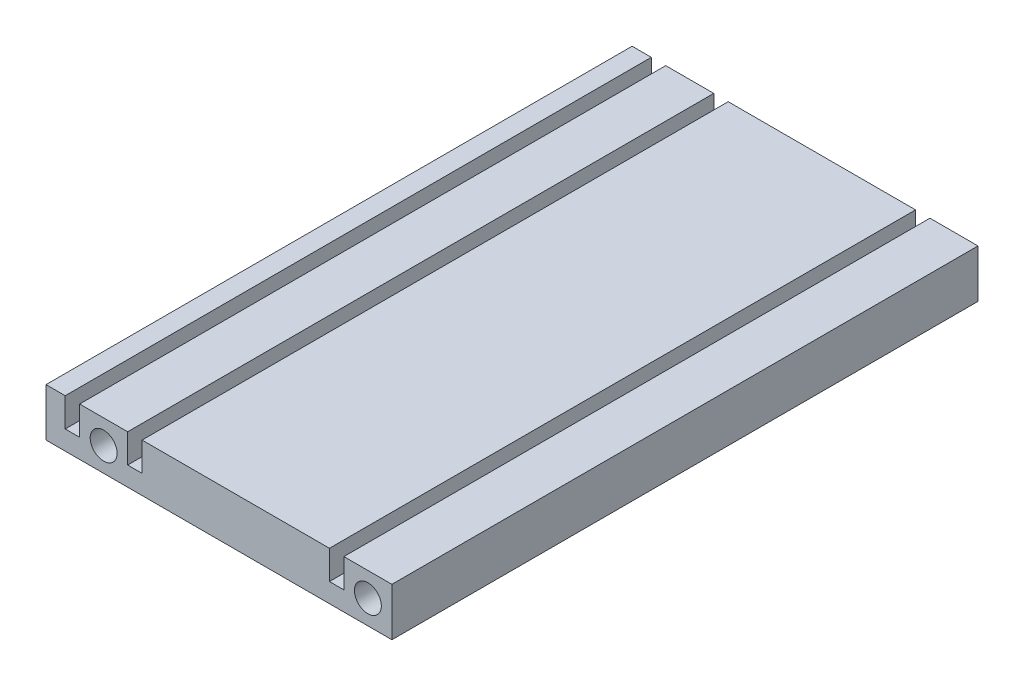
ISO-10303-21;
HEADER;
FILE_DESCRIPTION(('STEP AP214'),'2;1');
FILE_NAME('part.step','',(''),(''),'','','');
FILE_SCHEMA(('AUTOMOTIVE_DESIGN { 1 0 10303 214 1 1 1 1 }'));
ENDSEC;
DATA;
#1=APPLICATION_CONTEXT('core data for automotive mechanical design processes');
#2=APPLICATION_PROTOCOL_DEFINITION('international standard','automotive_design',2000,#1);
#3=PRODUCT_CONTEXT('',#1,'mechanical');
#4=PRODUCT('Part','Part','',(#3));
#5=PRODUCT_RELATED_PRODUCT_CATEGORY('part','',(#4));
#6=PRODUCT_DEFINITION_FORMATION('','',#4);
#7=PRODUCT_DEFINITION_CONTEXT('part definition',#1,'design');
#8=PRODUCT_DEFINITION('design','',#6,#7);
#9=PRODUCT_DEFINITION_SHAPE('','',#8);
#10=(LENGTH_UNIT() NAMED_UNIT(*) SI_UNIT(.MILLI.,.METRE.));
#11=(NAMED_UNIT(*) PLANE_ANGLE_UNIT() SI_UNIT($,.RADIAN.));
#12=(NAMED_UNIT(*) SI_UNIT($,.STERADIAN.) SOLID_ANGLE_UNIT());
#13=UNCERTAINTY_MEASURE_WITH_UNIT(LENGTH_MEASURE(1.E-05),#10,'distance_accuracy_value','');
#14=(GEOMETRIC_REPRESENTATION_CONTEXT(3) GLOBAL_UNCERTAINTY_ASSIGNED_CONTEXT((#13)) GLOBAL_UNIT_ASSIGNED_CONTEXT((#10,
#11,#12)) REPRESENTATION_CONTEXT('',''));
#15=CARTESIAN_POINT('',(0.,0.,0.));
#16=DIRECTION('',(0.,0.,1.));
#17=DIRECTION('',(1.,0.,0.));
#18=AXIS2_PLACEMENT_3D('',#15,#16,#17);
#19=CARTESIAN_POINT('',(0.,0.,122.));
#20=DIRECTION('',(0.,0.,1.));
#21=DIRECTION('',(1.,0.,0.));
#22=AXIS2_PLACEMENT_3D('',#19,#20,#21);
#23=PLANE('',#22);
#24=CARTESIAN_POINT('',(31.1088733696482,1.91039679647407,122.));
#25=DIRECTION('',(0.,0.,1.));
#26=DIRECTION('',(1.,0.,0.));
#27=AXIS2_PLACEMENT_3D('',#24,#25,#26);
#28=CIRCLE('',#27,2.80000000000001);
#29=CARTESIAN_POINT('',(33.9088733696482,1.91039679647407,122.));
#30=VERTEX_POINT('',#29);
#31=EDGE_CURVE('E290',#30,#30,#28,.T.);
#32=ORIENTED_EDGE('',*,*,#31,.F.);
#33=EDGE_LOOP('',(#32));
#34=FACE_BOUND('',#33,.T.);
#35=DIRECTION('',(1.,0.,0.));
#36=VECTOR('',#35,1.);
#37=CARTESIAN_POINT('',(-31.8911266303518,0.910396796474061,122.));
#38=LINE('',#37,#36);
#39=CARTESIAN_POINT('',(-31.8911266303518,0.910396796474061,122.));
#40=VERTEX_POINT('',#39);
#41=CARTESIAN_POINT('',(-28.8911266303518,0.910396796474061,122.));
#42=VERTEX_POINT('',#41);
#43=EDGE_CURVE('E331',#40,#42,#38,.T.);
#44=ORIENTED_EDGE('',*,*,#43,.F.);
#45=DIRECTION('',(0.,-1.,0.));
#46=VECTOR('',#45,1.);
#47=CARTESIAN_POINT('',(-31.8911266303518,6.91039679647406,122.));
#48=LINE('',#47,#46);
#49=CARTESIAN_POINT('',(-31.8911266303518,6.91039679647406,122.));
#50=VERTEX_POINT('',#49);
#51=EDGE_CURVE('E276',#50,#40,#48,.T.);
#52=ORIENTED_EDGE('',*,*,#51,.F.);
#53=DIRECTION('',(1.,0.,0.));
#54=VECTOR('',#53,1.);
#55=CARTESIAN_POINT('',(-35.8911266303518,6.91039679647406,122.));
#56=LINE('',#55,#54);
#57=CARTESIAN_POINT('',(-35.8911266303518,6.91039679647406,122.));
#58=VERTEX_POINT('',#57);
#59=EDGE_CURVE('E261',#58,#50,#56,.T.);
#60=ORIENTED_EDGE('',*,*,#59,.F.);
#61=DIRECTION('',(0.,1.,0.));
#62=VECTOR('',#61,1.);
#63=CARTESIAN_POINT('',(-35.8911266303518,-3.08960320352594,122.));
#64=LINE('',#63,#62);
#65=CARTESIAN_POINT('',(-35.8911266303518,-3.08960320352594,122.));
#66=VERTEX_POINT('',#65);
#67=EDGE_CURVE('E274',#66,#58,#64,.T.);
#68=ORIENTED_EDGE('',*,*,#67,.F.);
#69=DIRECTION('',(-1.,0.,0.));
#70=VECTOR('',#69,1.);
#71=CARTESIAN_POINT('',(36.1088733696482,-3.08960320352593,122.));
#72=LINE('',#71,#70);
#73=CARTESIAN_POINT('',(36.1088733696482,-3.08960320352593,122.));
#74=VERTEX_POINT('',#73);
#75=EDGE_CURVE('E279',#74,#66,#72,.T.);
#76=ORIENTED_EDGE('',*,*,#75,.F.);
#77=DIRECTION('',(0.,-1.,0.));
#78=VECTOR('',#77,1.);
#79=CARTESIAN_POINT('',(36.1088733696482,6.91039679647406,122.));
#80=LINE('',#79,#78);
#81=CARTESIAN_POINT('',(36.1088733696482,6.91039679647406,122.));
#82=VERTEX_POINT('',#81);
#83=EDGE_CURVE('E281',#82,#74,#80,.T.);
#84=ORIENTED_EDGE('',*,*,#83,.F.);
#85=DIRECTION('',(1.,0.,0.));
#86=VECTOR('',#85,1.);
#87=CARTESIAN_POINT('',(26.1088733696482,6.91039679647406,122.));
#88=LINE('',#87,#86);
#89=CARTESIAN_POINT('',(26.1088733696482,6.91039679647406,122.));
#90=VERTEX_POINT('',#89);
#91=EDGE_CURVE('E429',#90,#82,#88,.T.);
#92=ORIENTED_EDGE('',*,*,#91,.F.);
#93=DIRECTION('',(0.,1.,0.));
#94=VECTOR('',#93,1.);
#95=CARTESIAN_POINT('',(26.1088733696482,0.910396796474062,122.));
#96=LINE('',#95,#94);
#97=CARTESIAN_POINT('',(26.1088733696482,0.910396796474062,122.));
#98=VERTEX_POINT('',#97);
#99=EDGE_CURVE('E426',#98,#90,#96,.T.);
#100=ORIENTED_EDGE('',*,*,#99,.F.);
#101=DIRECTION('',(1.,0.,0.));
#102=VECTOR('',#101,1.);
#103=CARTESIAN_POINT('',(23.1088733696482,0.910396796474062,122.));
#104=LINE('',#103,#102);
#105=CARTESIAN_POINT('',(23.1088733696482,0.910396796474062,122.));
#106=VERTEX_POINT('',#105);
#107=EDGE_CURVE('E423',#106,#98,#104,.T.);
#108=ORIENTED_EDGE('',*,*,#107,.F.);
#109=DIRECTION('',(0.,-1.,0.));
#110=VECTOR('',#109,1.);
#111=CARTESIAN_POINT('',(23.1088733696482,6.91039679647406,122.));
#112=LINE('',#111,#110);
#113=CARTESIAN_POINT('',(23.1088733696482,6.91039679647406,122.));
#114=VERTEX_POINT('',#113);
#115=EDGE_CURVE('E420',#114,#106,#112,.T.);
#116=ORIENTED_EDGE('',*,*,#115,.F.);
#117=DIRECTION('',(1.,0.,0.));
#118=VECTOR('',#117,1.);
#119=CARTESIAN_POINT('',(-15.8911266303518,6.91039679647406,122.));
#120=LINE('',#119,#118);
#121=CARTESIAN_POINT('',(-15.8911266303518,6.91039679647406,122.));
#122=VERTEX_POINT('',#121);
#123=EDGE_CURVE('E417',#122,#114,#120,.T.);
#124=ORIENTED_EDGE('',*,*,#123,.F.);
#125=DIRECTION('',(0.,1.,0.));
#126=VECTOR('',#125,1.);
#127=CARTESIAN_POINT('',(-15.8911266303518,0.910396796474061,122.));
#128=LINE('',#127,#126);
#129=CARTESIAN_POINT('',(-15.8911266303518,0.910396796474061,122.));
#130=VERTEX_POINT('',#129);
#131=EDGE_CURVE('E414',#130,#122,#128,.T.);
#132=ORIENTED_EDGE('',*,*,#131,.F.);
#133=DIRECTION('',(1.,0.,0.));
#134=VECTOR('',#133,1.);
#135=CARTESIAN_POINT('',(-18.8911266303518,0.910396796474061,122.));
#136=LINE('',#135,#134);
#137=CARTESIAN_POINT('',(-18.8911266303518,0.910396796474061,122.));
#138=VERTEX_POINT('',#137);
#139=EDGE_CURVE('E411',#138,#130,#136,.T.);
#140=ORIENTED_EDGE('',*,*,#139,.F.);
#141=DIRECTION('',(0.,-1.,0.));
#142=VECTOR('',#141,1.);
#143=CARTESIAN_POINT('',(-18.8911266303518,6.91039679647406,122.));
#144=LINE('',#143,#142);
#145=CARTESIAN_POINT('',(-18.8911266303518,6.91039679647406,122.));
#146=VERTEX_POINT('',#145);
#147=EDGE_CURVE('E408',#146,#138,#144,.T.);
#148=ORIENTED_EDGE('',*,*,#147,.F.);
#149=DIRECTION('',(1.,0.,0.));
#150=VECTOR('',#149,1.);
#151=CARTESIAN_POINT('',(-28.8911266303518,6.91039679647406,122.));
#152=LINE('',#151,#150);
#153=CARTESIAN_POINT('',(-28.8911266303518,6.91039679647406,122.));
#154=VERTEX_POINT('',#153);
#155=EDGE_CURVE('E405',#154,#146,#152,.T.);
#156=ORIENTED_EDGE('',*,*,#155,.F.);
#157=DIRECTION('',(0.,1.,0.));
#158=VECTOR('',#157,1.);
#159=CARTESIAN_POINT('',(-28.8911266303518,0.910396796474061,122.));
#160=LINE('',#159,#158);
#161=EDGE_CURVE('E403',#42,#154,#160,.T.);
#162=ORIENTED_EDGE('',*,*,#161,.F.);
#163=EDGE_LOOP('',(#44,#52,#60,#68,#76,#84,#92,#100,#108,#116,#124,#132,#140,#148,#156,#162));
#164=FACE_BOUND('',#163,.T.);
#165=CARTESIAN_POINT('',(-23.8911266303518,1.91039679647407,122.));
#166=DIRECTION('',(0.,0.,1.));
#167=DIRECTION('',(1.,0.,0.));
#168=AXIS2_PLACEMENT_3D('',#165,#166,#167);
#169=CIRCLE('',#168,2.8);
#170=CARTESIAN_POINT('',(-21.0911266303518,1.91039679647407,122.));
#171=VERTEX_POINT('',#170);
#172=EDGE_CURVE('E389',#171,#171,#169,.T.);
#173=ORIENTED_EDGE('',*,*,#172,.F.);
#174=EDGE_LOOP('',(#173));
#175=FACE_BOUND('',#174,.T.);
#176=ADVANCED_FACE('F140',(#34,#164,#175),#23,.T.);
#177=CARTESIAN_POINT('',(0.,0.,0.));
#178=DIRECTION('',(0.,0.,1.));
#179=DIRECTION('',(1.,0.,0.));
#180=AXIS2_PLACEMENT_3D('',#177,#178,#179);
#181=PLANE('',#180);
#182=DIRECTION('',(1.,0.,0.));
#183=VECTOR('',#182,1.);
#184=CARTESIAN_POINT('',(-31.8911266303518,0.910396796474061,0.));
#185=LINE('',#184,#183);
#186=CARTESIAN_POINT('',(-31.8911266303518,0.910396796474061,0.));
#187=VERTEX_POINT('',#186);
#188=CARTESIAN_POINT('',(-28.8911266303518,0.910396796474061,0.));
#189=VERTEX_POINT('',#188);
#190=EDGE_CURVE('E286',#187,#189,#185,.T.);
#191=ORIENTED_EDGE('',*,*,#190,.T.);
#192=DIRECTION('',(0.,1.,0.));
#193=VECTOR('',#192,1.);
#194=CARTESIAN_POINT('',(-28.8911266303518,0.910396796474061,0.));
#195=LINE('',#194,#193);
#196=CARTESIAN_POINT('',(-28.8911266303518,6.91039679647406,0.));
#197=VERTEX_POINT('',#196);
#198=EDGE_CURVE('E289',#189,#197,#195,.T.);
#199=ORIENTED_EDGE('',*,*,#198,.T.);
#200=DIRECTION('',(1.,0.,0.));
#201=VECTOR('',#200,1.);
#202=CARTESIAN_POINT('',(-28.8911266303518,6.91039679647406,0.));
#203=LINE('',#202,#201);
#204=CARTESIAN_POINT('',(-18.8911266303518,6.91039679647406,0.));
#205=VERTEX_POINT('',#204);
#206=EDGE_CURVE('E293',#197,#205,#203,.T.);
#207=ORIENTED_EDGE('',*,*,#206,.T.);
#208=DIRECTION('',(0.,-1.,0.));
#209=VECTOR('',#208,1.);
#210=CARTESIAN_POINT('',(-18.8911266303518,6.91039679647406,0.));
#211=LINE('',#210,#209);
#212=CARTESIAN_POINT('',(-18.8911266303518,0.910396796474061,0.));
#213=VERTEX_POINT('',#212);
#214=EDGE_CURVE('E296',#205,#213,#211,.T.);
#215=ORIENTED_EDGE('',*,*,#214,.T.);
#216=DIRECTION('',(1.,0.,0.));
#217=VECTOR('',#216,1.);
#218=CARTESIAN_POINT('',(-18.8911266303518,0.910396796474061,0.));
#219=LINE('',#218,#217);
#220=CARTESIAN_POINT('',(-15.8911266303518,0.910396796474061,0.));
#221=VERTEX_POINT('',#220);
#222=EDGE_CURVE('E299',#213,#221,#219,.T.);
#223=ORIENTED_EDGE('',*,*,#222,.T.);
#224=DIRECTION('',(0.,1.,0.));
#225=VECTOR('',#224,1.);
#226=CARTESIAN_POINT('',(-15.8911266303518,0.910396796474061,0.));
#227=LINE('',#226,#225);
#228=CARTESIAN_POINT('',(-15.8911266303518,6.91039679647406,0.));
#229=VERTEX_POINT('',#228);
#230=EDGE_CURVE('E302',#221,#229,#227,.T.);
#231=ORIENTED_EDGE('',*,*,#230,.T.);
#232=DIRECTION('',(1.,0.,0.));
#233=VECTOR('',#232,1.);
#234=CARTESIAN_POINT('',(-15.8911266303518,6.91039679647406,0.));
#235=LINE('',#234,#233);
#236=CARTESIAN_POINT('',(23.1088733696482,6.91039679647406,0.));
#237=VERTEX_POINT('',#236);
#238=EDGE_CURVE('E305',#229,#237,#235,.T.);
#239=ORIENTED_EDGE('',*,*,#238,.T.);
#240=DIRECTION('',(0.,-1.,0.));
#241=VECTOR('',#240,1.);
#242=CARTESIAN_POINT('',(23.1088733696482,6.91039679647406,0.));
#243=LINE('',#242,#241);
#244=CARTESIAN_POINT('',(23.1088733696482,0.910396796474062,0.));
#245=VERTEX_POINT('',#244);
#246=EDGE_CURVE('E308',#237,#245,#243,.T.);
#247=ORIENTED_EDGE('',*,*,#246,.T.);
#248=DIRECTION('',(1.,0.,0.));
#249=VECTOR('',#248,1.);
#250=CARTESIAN_POINT('',(23.1088733696482,0.910396796474062,0.));
#251=LINE('',#250,#249);
#252=CARTESIAN_POINT('',(26.1088733696482,0.910396796474062,0.));
#253=VERTEX_POINT('',#252);
#254=EDGE_CURVE('E311',#245,#253,#251,.T.);
#255=ORIENTED_EDGE('',*,*,#254,.T.);
#256=DIRECTION('',(0.,1.,0.));
#257=VECTOR('',#256,1.);
#258=CARTESIAN_POINT('',(26.1088733696482,0.910396796474062,0.));
#259=LINE('',#258,#257);
#260=CARTESIAN_POINT('',(26.1088733696482,6.91039679647406,0.));
#261=VERTEX_POINT('',#260);
#262=EDGE_CURVE('E314',#253,#261,#259,.T.);
#263=ORIENTED_EDGE('',*,*,#262,.T.);
#264=DIRECTION('',(1.,0.,0.));
#265=VECTOR('',#264,1.);
#266=CARTESIAN_POINT('',(26.1088733696482,6.91039679647406,0.));
#267=LINE('',#266,#265);
#268=CARTESIAN_POINT('',(36.1088733696482,6.91039679647406,0.));
#269=VERTEX_POINT('',#268);
#270=EDGE_CURVE('E317',#261,#269,#267,.T.);
#271=ORIENTED_EDGE('',*,*,#270,.T.);
#272=DIRECTION('',(0.,-1.,0.));
#273=VECTOR('',#272,1.);
#274=CARTESIAN_POINT('',(36.1088733696482,6.91039679647406,0.));
#275=LINE('',#274,#273);
#276=CARTESIAN_POINT('',(36.1088733696482,-3.08960320352593,0.));
#277=VERTEX_POINT('',#276);
#278=EDGE_CURVE('E320',#269,#277,#275,.T.);
#279=ORIENTED_EDGE('',*,*,#278,.T.);
#280=DIRECTION('',(-1.,0.,0.));
#281=VECTOR('',#280,1.);
#282=CARTESIAN_POINT('',(36.1088733696482,-3.08960320352593,0.));
#283=LINE('',#282,#281);
#284=CARTESIAN_POINT('',(-35.8911266303518,-3.08960320352594,0.));
#285=VERTEX_POINT('',#284);
#286=EDGE_CURVE('E323',#277,#285,#283,.T.);
#287=ORIENTED_EDGE('',*,*,#286,.T.);
#288=DIRECTION('',(0.,1.,0.));
#289=VECTOR('',#288,1.);
#290=CARTESIAN_POINT('',(-35.8911266303518,-3.08960320352594,0.));
#291=LINE('',#290,#289);
#292=CARTESIAN_POINT('',(-35.8911266303518,6.91039679647406,0.));
#293=VERTEX_POINT('',#292);
#294=EDGE_CURVE('E326',#285,#293,#291,.T.);
#295=ORIENTED_EDGE('',*,*,#294,.T.);
#296=DIRECTION('',(1.,0.,0.));
#297=VECTOR('',#296,1.);
#298=CARTESIAN_POINT('',(-35.8911266303518,6.91039679647406,0.));
#299=LINE('',#298,#297);
#300=CARTESIAN_POINT('',(-31.8911266303518,6.91039679647406,0.));
#301=VERTEX_POINT('',#300);
#302=EDGE_CURVE('E263',#293,#301,#299,.T.);
#303=ORIENTED_EDGE('',*,*,#302,.T.);
#304=DIRECTION('',(0.,-1.,0.));
#305=VECTOR('',#304,1.);
#306=CARTESIAN_POINT('',(-31.8911266303518,6.91039679647406,0.));
#307=LINE('',#306,#305);
#308=EDGE_CURVE('E329',#301,#187,#307,.T.);
#309=ORIENTED_EDGE('',*,*,#308,.T.);
#310=EDGE_LOOP('',(#191,#199,#207,#215,#223,#231,#239,#247,#255,#263,#271,#279,#287,#295,#303,#309));
#311=FACE_BOUND('',#310,.T.);
#312=CARTESIAN_POINT('',(31.1088733696482,1.91039679647407,0.));
#313=DIRECTION('',(0.,0.,1.));
#314=DIRECTION('',(1.,0.,0.));
#315=AXIS2_PLACEMENT_3D('',#312,#313,#314);
#316=CIRCLE('',#315,2.80000000000001);
#317=CARTESIAN_POINT('',(33.9088733696482,1.91039679647407,0.));
#318=VERTEX_POINT('',#317);
#319=EDGE_CURVE('E395',#318,#318,#316,.T.);
#320=ORIENTED_EDGE('',*,*,#319,.T.);
#321=EDGE_LOOP('',(#320));
#322=FACE_BOUND('',#321,.T.);
#323=CARTESIAN_POINT('',(-23.8911266303518,1.91039679647407,0.));
#324=DIRECTION('',(0.,0.,1.));
#325=DIRECTION('',(1.,0.,0.));
#326=AXIS2_PLACEMENT_3D('',#323,#324,#325);
#327=CIRCLE('',#326,2.8);
#328=CARTESIAN_POINT('',(-21.0911266303518,1.91039679647407,0.));
#329=VERTEX_POINT('',#328);
#330=EDGE_CURVE('E392',#329,#329,#327,.T.);
#331=ORIENTED_EDGE('',*,*,#330,.T.);
#332=EDGE_LOOP('',(#331));
#333=FACE_BOUND('',#332,.T.);
#334=ADVANCED_FACE('F358',(#311,#322,#333),#181,.F.);
#335=CARTESIAN_POINT('',(-31.8911266303518,0.910396796474061,122.));
#336=DIRECTION('',(0.,1.,0.));
#337=DIRECTION('',(0.,0.,1.));
#338=AXIS2_PLACEMENT_3D('',#335,#336,#337);
#339=PLANE('',#338);
#340=ORIENTED_EDGE('',*,*,#190,.F.);
#341=DIRECTION('',(0.,0.,-1.));
#342=VECTOR('',#341,1.);
#343=CARTESIAN_POINT('',(-31.8911266303518,0.910396796474061,122.));
#344=LINE('',#343,#342);
#345=EDGE_CURVE('E12',#40,#187,#344,.T.);
#346=ORIENTED_EDGE('',*,*,#345,.F.);
#347=ORIENTED_EDGE('',*,*,#43,.T.);
#348=DIRECTION('',(0.,0.,-1.));
#349=VECTOR('',#348,1.);
#350=CARTESIAN_POINT('',(-28.8911266303518,0.910396796474061,122.));
#351=LINE('',#350,#349);
#352=EDGE_CURVE('E144',#42,#189,#351,.T.);
#353=ORIENTED_EDGE('',*,*,#352,.T.);
#354=EDGE_LOOP('',(#340,#346,#347,#353));
#355=FACE_BOUND('',#354,.T.);
#356=ADVANCED_FACE('F142',(#355),#339,.T.);
#357=CARTESIAN_POINT('',(-31.8911266303518,6.91039679647406,122.));
#358=DIRECTION('',(1.,0.,0.));
#359=DIRECTION('',(0.,0.,-1.));
#360=AXIS2_PLACEMENT_3D('',#357,#358,#359);
#361=PLANE('',#360);
#362=ORIENTED_EDGE('',*,*,#308,.F.);
#363=DIRECTION('',(0.,0.,-1.));
#364=VECTOR('',#363,1.);
#365=CARTESIAN_POINT('',(-31.8911266303518,6.91039679647406,122.));
#366=LINE('',#365,#364);
#367=EDGE_CURVE('E150',#50,#301,#366,.T.);
#368=ORIENTED_EDGE('',*,*,#367,.F.);
#369=ORIENTED_EDGE('',*,*,#51,.T.);
#370=ORIENTED_EDGE('',*,*,#345,.T.);
#371=EDGE_LOOP('',(#362,#368,#369,#370));
#372=FACE_BOUND('',#371,.T.);
#373=ADVANCED_FACE('F360',(#372),#361,.T.);
#374=CARTESIAN_POINT('',(-35.8911266303518,6.91039679647406,122.));
#375=DIRECTION('',(0.,1.,0.));
#376=DIRECTION('',(-1.,0.,0.));
#377=AXIS2_PLACEMENT_3D('',#374,#375,#376);
#378=PLANE('',#377);
#379=ORIENTED_EDGE('',*,*,#302,.F.);
#380=DIRECTION('',(0.,0.,-1.));
#381=VECTOR('',#380,1.);
#382=CARTESIAN_POINT('',(-35.8911266303518,6.91039679647406,122.));
#383=LINE('',#382,#381);
#384=EDGE_CURVE('E258',#58,#293,#383,.T.);
#385=ORIENTED_EDGE('',*,*,#384,.F.);
#386=ORIENTED_EDGE('',*,*,#59,.T.);
#387=ORIENTED_EDGE('',*,*,#367,.T.);
#388=EDGE_LOOP('',(#379,#385,#386,#387));
#389=FACE_BOUND('',#388,.T.);
#390=ADVANCED_FACE('F260',(#389),#378,.T.);
#391=CARTESIAN_POINT('',(-35.8911266303518,-3.08960320352594,122.));
#392=DIRECTION('',(-1.,0.,0.));
#393=DIRECTION('',(0.,0.,1.));
#394=AXIS2_PLACEMENT_3D('',#391,#392,#393);
#395=PLANE('',#394);
#396=ORIENTED_EDGE('',*,*,#294,.F.);
#397=DIRECTION('',(0.,0.,-1.));
#398=VECTOR('',#397,1.);
#399=CARTESIAN_POINT('',(-35.8911266303518,-3.08960320352594,122.));
#400=LINE('',#399,#398);
#401=EDGE_CURVE('E268',#66,#285,#400,.T.);
#402=ORIENTED_EDGE('',*,*,#401,.F.);
#403=ORIENTED_EDGE('',*,*,#67,.T.);
#404=ORIENTED_EDGE('',*,*,#384,.T.);
#405=EDGE_LOOP('',(#396,#402,#403,#404));
#406=FACE_BOUND('',#405,.T.);
#407=ADVANCED_FACE('F278',(#406),#395,.T.);
#408=CARTESIAN_POINT('',(36.1088733696482,-3.08960320352593,122.));
#409=DIRECTION('',(0.,-1.,0.));
#410=DIRECTION('',(1.,0.,0.));
#411=AXIS2_PLACEMENT_3D('',#408,#409,#410);
#412=PLANE('',#411);
#413=ORIENTED_EDGE('',*,*,#286,.F.);
#414=DIRECTION('',(0.,0.,-1.));
#415=VECTOR('',#414,1.);
#416=CARTESIAN_POINT('',(36.1088733696482,-3.08960320352593,122.));
#417=LINE('',#416,#415);
#418=EDGE_CURVE('E335',#74,#277,#417,.T.);
#419=ORIENTED_EDGE('',*,*,#418,.F.);
#420=ORIENTED_EDGE('',*,*,#75,.T.);
#421=ORIENTED_EDGE('',*,*,#401,.T.);
#422=EDGE_LOOP('',(#413,#419,#420,#421));
#423=FACE_BOUND('',#422,.T.);
#424=ADVANCED_FACE('F473',(#423),#412,.T.);
#425=CARTESIAN_POINT('',(36.1088733696482,6.91039679647406,122.));
#426=DIRECTION('',(1.,0.,0.));
#427=DIRECTION('',(0.,0.,-1.));
#428=AXIS2_PLACEMENT_3D('',#425,#426,#427);
#429=PLANE('',#428);
#430=ORIENTED_EDGE('',*,*,#278,.F.);
#431=DIRECTION('',(0.,0.,-1.));
#432=VECTOR('',#431,1.);
#433=CARTESIAN_POINT('',(36.1088733696482,6.91039679647406,122.));
#434=LINE('',#433,#432);
#435=EDGE_CURVE('E337',#82,#269,#434,.T.);
#436=ORIENTED_EDGE('',*,*,#435,.F.);
#437=ORIENTED_EDGE('',*,*,#83,.T.);
#438=ORIENTED_EDGE('',*,*,#418,.T.);
#439=EDGE_LOOP('',(#430,#436,#437,#438));
#440=FACE_BOUND('',#439,.T.);
#441=ADVANCED_FACE('F435',(#440),#429,.T.);
#442=CARTESIAN_POINT('',(26.1088733696482,6.91039679647406,122.));
#443=DIRECTION('',(0.,1.,0.));
#444=DIRECTION('',(-1.,0.,0.));
#445=AXIS2_PLACEMENT_3D('',#442,#443,#444);
#446=PLANE('',#445);
#447=ORIENTED_EDGE('',*,*,#270,.F.);
#448=DIRECTION('',(0.,0.,-1.));
#449=VECTOR('',#448,1.);
#450=CARTESIAN_POINT('',(26.1088733696482,6.91039679647406,122.));
#451=LINE('',#450,#449);
#452=EDGE_CURVE('E339',#90,#261,#451,.T.);
#453=ORIENTED_EDGE('',*,*,#452,.F.);
#454=ORIENTED_EDGE('',*,*,#91,.T.);
#455=ORIENTED_EDGE('',*,*,#435,.T.);
#456=EDGE_LOOP('',(#447,#453,#454,#455));
#457=FACE_BOUND('',#456,.T.);
#458=ADVANCED_FACE('F441',(#457),#446,.T.);
#459=CARTESIAN_POINT('',(26.1088733696482,0.910396796474062,122.));
#460=DIRECTION('',(-1.,0.,0.));
#461=DIRECTION('',(0.,0.,1.));
#462=AXIS2_PLACEMENT_3D('',#459,#460,#461);
#463=PLANE('',#462);
#464=ORIENTED_EDGE('',*,*,#262,.F.);
#465=DIRECTION('',(0.,0.,-1.));
#466=VECTOR('',#465,1.);
#467=CARTESIAN_POINT('',(26.1088733696482,0.910396796474062,122.));
#468=LINE('',#467,#466);
#469=EDGE_CURVE('E341',#98,#253,#468,.T.);
#470=ORIENTED_EDGE('',*,*,#469,.F.);
#471=ORIENTED_EDGE('',*,*,#99,.T.);
#472=ORIENTED_EDGE('',*,*,#452,.T.);
#473=EDGE_LOOP('',(#464,#470,#471,#472));
#474=FACE_BOUND('',#473,.T.);
#475=ADVANCED_FACE('F444',(#474),#463,.T.);
#476=CARTESIAN_POINT('',(23.1088733696482,0.910396796474062,122.));
#477=DIRECTION('',(0.,1.,0.));
#478=DIRECTION('',(0.,0.,1.));
#479=AXIS2_PLACEMENT_3D('',#476,#477,#478);
#480=PLANE('',#479);
#481=ORIENTED_EDGE('',*,*,#254,.F.);
#482=DIRECTION('',(0.,0.,-1.));
#483=VECTOR('',#482,1.);
#484=CARTESIAN_POINT('',(23.1088733696482,0.910396796474062,122.));
#485=LINE('',#484,#483);
#486=EDGE_CURVE('E343',#106,#245,#485,.T.);
#487=ORIENTED_EDGE('',*,*,#486,.F.);
#488=ORIENTED_EDGE('',*,*,#107,.T.);
#489=ORIENTED_EDGE('',*,*,#469,.T.);
#490=EDGE_LOOP('',(#481,#487,#488,#489));
#491=FACE_BOUND('',#490,.T.);
#492=ADVANCED_FACE('F449',(#491),#480,.T.);
#493=CARTESIAN_POINT('',(23.1088733696482,6.91039679647406,122.));
#494=DIRECTION('',(1.,0.,0.));
#495=DIRECTION('',(0.,0.,-1.));
#496=AXIS2_PLACEMENT_3D('',#493,#494,#495);
#497=PLANE('',#496);
#498=ORIENTED_EDGE('',*,*,#246,.F.);
#499=DIRECTION('',(0.,0.,-1.));
#500=VECTOR('',#499,1.);
#501=CARTESIAN_POINT('',(23.1088733696482,6.91039679647406,122.));
#502=LINE('',#501,#500);
#503=EDGE_CURVE('E345',#114,#237,#502,.T.);
#504=ORIENTED_EDGE('',*,*,#503,.F.);
#505=ORIENTED_EDGE('',*,*,#115,.T.);
#506=ORIENTED_EDGE('',*,*,#486,.T.);
#507=EDGE_LOOP('',(#498,#504,#505,#506));
#508=FACE_BOUND('',#507,.T.);
#509=ADVANCED_FACE('F452',(#508),#497,.T.);
#510=CARTESIAN_POINT('',(-15.8911266303518,6.91039679647406,122.));
#511=DIRECTION('',(0.,1.,0.));
#512=DIRECTION('',(0.,0.,1.));
#513=AXIS2_PLACEMENT_3D('',#510,#511,#512);
#514=PLANE('',#513);
#515=ORIENTED_EDGE('',*,*,#238,.F.);
#516=DIRECTION('',(0.,0.,-1.));
#517=VECTOR('',#516,1.);
#518=CARTESIAN_POINT('',(-15.8911266303518,6.91039679647406,122.));
#519=LINE('',#518,#517);
#520=EDGE_CURVE('E347',#122,#229,#519,.T.);
#521=ORIENTED_EDGE('',*,*,#520,.F.);
#522=ORIENTED_EDGE('',*,*,#123,.T.);
#523=ORIENTED_EDGE('',*,*,#503,.T.);
#524=EDGE_LOOP('',(#515,#521,#522,#523));
#525=FACE_BOUND('',#524,.T.);
#526=ADVANCED_FACE('F457',(#525),#514,.T.);
#527=CARTESIAN_POINT('',(-15.8911266303518,0.910396796474061,122.));
#528=DIRECTION('',(-1.,0.,0.));
#529=DIRECTION('',(0.,0.,1.));
#530=AXIS2_PLACEMENT_3D('',#527,#528,#529);
#531=PLANE('',#530);
#532=ORIENTED_EDGE('',*,*,#230,.F.);
#533=DIRECTION('',(0.,0.,-1.));
#534=VECTOR('',#533,1.);
#535=CARTESIAN_POINT('',(-15.8911266303518,0.910396796474061,122.));
#536=LINE('',#535,#534);
#537=EDGE_CURVE('E349',#130,#221,#536,.T.);
#538=ORIENTED_EDGE('',*,*,#537,.F.);
#539=ORIENTED_EDGE('',*,*,#131,.T.);
#540=ORIENTED_EDGE('',*,*,#520,.T.);
#541=EDGE_LOOP('',(#532,#538,#539,#540));
#542=FACE_BOUND('',#541,.T.);
#543=ADVANCED_FACE('F460',(#542),#531,.T.);
#544=CARTESIAN_POINT('',(-18.8911266303518,0.910396796474061,122.));
#545=DIRECTION('',(0.,1.,0.));
#546=DIRECTION('',(0.,0.,1.));
#547=AXIS2_PLACEMENT_3D('',#544,#545,#546);
#548=PLANE('',#547);
#549=ORIENTED_EDGE('',*,*,#222,.F.);
#550=DIRECTION('',(0.,0.,-1.));
#551=VECTOR('',#550,1.);
#552=CARTESIAN_POINT('',(-18.8911266303518,0.910396796474061,122.));
#553=LINE('',#552,#551);
#554=EDGE_CURVE('E351',#138,#213,#553,.T.);
#555=ORIENTED_EDGE('',*,*,#554,.F.);
#556=ORIENTED_EDGE('',*,*,#139,.T.);
#557=ORIENTED_EDGE('',*,*,#537,.T.);
#558=EDGE_LOOP('',(#549,#555,#556,#557));
#559=FACE_BOUND('',#558,.T.);
#560=ADVANCED_FACE('F465',(#559),#548,.T.);
#561=CARTESIAN_POINT('',(-18.8911266303518,6.91039679647406,122.));
#562=DIRECTION('',(1.,0.,0.));
#563=DIRECTION('',(0.,1.,0.));
#564=AXIS2_PLACEMENT_3D('',#561,#562,#563);
#565=PLANE('',#564);
#566=ORIENTED_EDGE('',*,*,#214,.F.);
#567=DIRECTION('',(0.,0.,-1.));
#568=VECTOR('',#567,1.);
#569=CARTESIAN_POINT('',(-18.8911266303518,6.91039679647406,122.));
#570=LINE('',#569,#568);
#571=EDGE_CURVE('E353',#146,#205,#570,.T.);
#572=ORIENTED_EDGE('',*,*,#571,.F.);
#573=ORIENTED_EDGE('',*,*,#147,.T.);
#574=ORIENTED_EDGE('',*,*,#554,.T.);
#575=EDGE_LOOP('',(#566,#572,#573,#574));
#576=FACE_BOUND('',#575,.T.);
#577=ADVANCED_FACE('F468',(#576),#565,.T.);
#578=CARTESIAN_POINT('',(-28.8911266303518,6.91039679647406,122.));
#579=DIRECTION('',(0.,1.,0.));
#580=DIRECTION('',(0.,0.,1.));
#581=AXIS2_PLACEMENT_3D('',#578,#579,#580);
#582=PLANE('',#581);
#583=ORIENTED_EDGE('',*,*,#206,.F.);
#584=DIRECTION('',(0.,0.,-1.));
#585=VECTOR('',#584,1.);
#586=CARTESIAN_POINT('',(-28.8911266303518,6.91039679647406,122.));
#587=LINE('',#586,#585);
#588=EDGE_CURVE('E354',#154,#197,#587,.T.);
#589=ORIENTED_EDGE('',*,*,#588,.F.);
#590=ORIENTED_EDGE('',*,*,#155,.T.);
#591=ORIENTED_EDGE('',*,*,#571,.T.);
#592=EDGE_LOOP('',(#583,#589,#590,#591));
#593=FACE_BOUND('',#592,.T.);
#594=ADVANCED_FACE('F471',(#593),#582,.T.);
#595=CARTESIAN_POINT('',(-28.8911266303518,0.910396796474061,122.));
#596=DIRECTION('',(-1.,0.,0.));
#597=DIRECTION('',(0.,-1.,0.));
#598=AXIS2_PLACEMENT_3D('',#595,#596,#597);
#599=PLANE('',#598);
#600=ORIENTED_EDGE('',*,*,#198,.F.);
#601=ORIENTED_EDGE('',*,*,#352,.F.);
#602=ORIENTED_EDGE('',*,*,#161,.T.);
#603=ORIENTED_EDGE('',*,*,#588,.T.);
#604=EDGE_LOOP('',(#600,#601,#602,#603));
#605=FACE_BOUND('',#604,.T.);
#606=ADVANCED_FACE('F356',(#605),#599,.T.);
#607=CARTESIAN_POINT('',(31.1088733696482,1.91039679647407,122.));
#608=DIRECTION('',(0.,0.,-1.));
#609=DIRECTION('',(-1.,0.,0.));
#610=AXIS2_PLACEMENT_3D('',#607,#608,#609);
#611=CYLINDRICAL_SURFACE('',#610,2.80000000000001);
#612=ORIENTED_EDGE('',*,*,#31,.T.);
#613=EDGE_LOOP('',(#612));
#614=FACE_BOUND('',#613,.T.);
#615=ORIENTED_EDGE('',*,*,#319,.F.);
#616=EDGE_LOOP('',(#615));
#617=FACE_BOUND('',#616,.T.);
#618=ADVANCED_FACE('F377',(#614,#617),#611,.F.);
#619=CARTESIAN_POINT('',(-23.8911266303518,1.91039679647407,122.));
#620=DIRECTION('',(0.,0.,-1.));
#621=DIRECTION('',(-1.,0.,0.));
#622=AXIS2_PLACEMENT_3D('',#619,#620,#621);
#623=CYLINDRICAL_SURFACE('',#622,2.8);
#624=ORIENTED_EDGE('',*,*,#172,.T.);
#625=EDGE_LOOP('',(#624));
#626=FACE_BOUND('',#625,.T.);
#627=ORIENTED_EDGE('',*,*,#330,.F.);
#628=EDGE_LOOP('',(#627));
#629=FACE_BOUND('',#628,.T.);
#630=ADVANCED_FACE('F380',(#626,#629),#623,.F.);
#631=CLOSED_SHELL('',(#176,#334,#356,#373,#390,#407,#424,#441,#458,#475,#492,#509,#526,#543,
#560,#577,#594,#606,#618,#630));
#632=MANIFOLD_SOLID_BREP('B2',#631);
#633=ADVANCED_BREP_SHAPE_REPRESENTATION('',(#18,#632),#14);
#634=SHAPE_DEFINITION_REPRESENTATION(#9,#633);
ENDSEC;
END-ISO-10303-21;
